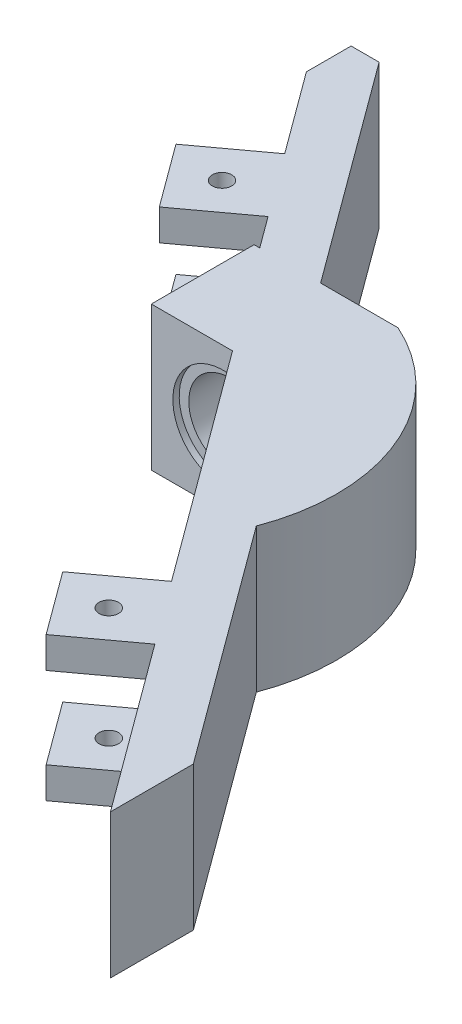
ISO-10303-21;
HEADER;
FILE_DESCRIPTION(('STEP AP214'),'2;1');
FILE_NAME('part.step','',(''),(''),'','','');
FILE_SCHEMA(('AUTOMOTIVE_DESIGN { 1 0 10303 214 1 1 1 1 }'));
ENDSEC;
DATA;
#1=APPLICATION_CONTEXT('core data for automotive mechanical design processes');
#2=APPLICATION_PROTOCOL_DEFINITION('international standard','automotive_design',2000,#1);
#3=PRODUCT_CONTEXT('',#1,'mechanical');
#4=PRODUCT('Part','Part','',(#3));
#5=PRODUCT_RELATED_PRODUCT_CATEGORY('part','',(#4));
#6=PRODUCT_DEFINITION_FORMATION('','',#4);
#7=PRODUCT_DEFINITION_CONTEXT('part definition',#1,'design');
#8=PRODUCT_DEFINITION('design','',#6,#7);
#9=PRODUCT_DEFINITION_SHAPE('','',#8);
#10=(LENGTH_UNIT() NAMED_UNIT(*) SI_UNIT(.MILLI.,.METRE.));
#11=(NAMED_UNIT(*) PLANE_ANGLE_UNIT() SI_UNIT($,.RADIAN.));
#12=(NAMED_UNIT(*) SI_UNIT($,.STERADIAN.) SOLID_ANGLE_UNIT());
#13=UNCERTAINTY_MEASURE_WITH_UNIT(LENGTH_MEASURE(1.E-05),#10,'distance_accuracy_value','');
#14=(GEOMETRIC_REPRESENTATION_CONTEXT(3) GLOBAL_UNCERTAINTY_ASSIGNED_CONTEXT((#13)) GLOBAL_UNIT_ASSIGNED_CONTEXT((#10,
#11,#12)) REPRESENTATION_CONTEXT('',''));
#15=CARTESIAN_POINT('',(0.,0.,0.));
#16=DIRECTION('',(0.,0.,1.));
#17=DIRECTION('',(1.,0.,0.));
#18=AXIS2_PLACEMENT_3D('',#15,#16,#17);
#19=CARTESIAN_POINT('',(0.,18.5,0.));
#20=DIRECTION('',(0.805831670150136,0.,-0.592144677746109));
#21=DIRECTION('',(-0.592144677746109,0.,-0.805831670150136));
#22=AXIS2_PLACEMENT_3D('',#19,#20,#21);
#23=PLANE('',#22);
#24=DIRECTION('',(0.,-1.,0.));
#25=VECTOR('',#24,1.);
#26=CARTESIAN_POINT('',(48.0556292359009,18.5,65.3974432645083));
#27=LINE('',#26,#25);
#28=CARTESIAN_POINT('',(48.0556292359009,18.5,65.3974432645083));
#29=VERTEX_POINT('',#28);
#30=CARTESIAN_POINT('',(48.0556292359009,14.5,65.3974432645083));
#31=VERTEX_POINT('',#30);
#32=EDGE_CURVE('E313',#29,#31,#27,.T.);
#33=ORIENTED_EDGE('',*,*,#32,.F.);
#34=DIRECTION('',(0.592144677746109,0.,0.805831670150136));
#35=VECTOR('',#34,1.);
#36=CARTESIAN_POINT('',(0.,18.5,0.));
#37=LINE('',#36,#35);
#38=CARTESIAN_POINT('',(26.3184133701517,18.5,35.8159277602497));
#39=VERTEX_POINT('',#38);
#40=EDGE_CURVE('E498',#39,#29,#37,.T.);
#41=ORIENTED_EDGE('',*,*,#40,.F.);
#42=DIRECTION('',(0.,1.,0.));
#43=VECTOR('',#42,1.);
#44=CARTESIAN_POINT('',(26.3184133701517,18.5,35.8159277602497));
#45=LINE('',#44,#43);
#46=CARTESIAN_POINT('',(26.3184133701517,15.6442222293234,35.8159277602497));
#47=VERTEX_POINT('',#46);
#48=EDGE_CURVE('E461',#47,#39,#45,.T.);
#49=ORIENTED_EDGE('',*,*,#48,.F.);
#50=CARTESIAN_POINT('',(25.1505426230111,9.25,34.2266080043585));
#51=DIRECTION('',(0.805831670150136,0.,-0.592144677746109));
#52=DIRECTION('',(-0.592144677746109,0.,-0.805831670150136));
#53=AXIS2_PLACEMENT_3D('',#50,#51,#52);
#54=ELLIPSE('',#53,10.9770470702212,6.5);
#55=CARTESIAN_POINT('',(26.3184133701517,2.8557777706766,35.8159277602497));
#56=VERTEX_POINT('',#55);
#57=EDGE_CURVE('E290',#56,#47,#54,.F.);
#58=ORIENTED_EDGE('',*,*,#57,.F.);
#59=CARTESIAN_POINT('',(26.3184133701517,0.,35.8159277602497));
#60=VERTEX_POINT('',#59);
#61=EDGE_CURVE('E462',#60,#56,#45,.T.);
#62=ORIENTED_EDGE('',*,*,#61,.F.);
#63=DIRECTION('',(0.592144677746109,0.,0.805831670150136));
#64=VECTOR('',#63,1.);
#65=CARTESIAN_POINT('',(0.,0.,0.));
#66=LINE('',#65,#64);
#67=CARTESIAN_POINT('',(48.0556292359009,0.,65.3974432645083));
#68=VERTEX_POINT('',#67);
#69=EDGE_CURVE('E272',#60,#68,#66,.T.);
#70=ORIENTED_EDGE('',*,*,#69,.T.);
#71=DIRECTION('',(0.,-1.,0.));
#72=VECTOR('',#71,1.);
#73=CARTESIAN_POINT('',(48.0556292359009,0.,65.3974432645083));
#74=LINE('',#73,#72);
#75=CARTESIAN_POINT('',(48.0556292359009,4.,65.3974432645083));
#76=VERTEX_POINT('',#75);
#77=EDGE_CURVE('E59',#76,#68,#74,.T.);
#78=ORIENTED_EDGE('',*,*,#77,.F.);
#79=DIRECTION('',(-0.592144677746109,0.,-0.805831670150136));
#80=VECTOR('',#79,1.);
#81=CARTESIAN_POINT('',(48.0556292359009,4.,65.3974432645083));
#82=LINE('',#81,#80);
#83=CARTESIAN_POINT('',(53.977076013362,4.,73.4557599660097));
#84=VERTEX_POINT('',#83);
#85=EDGE_CURVE('E341',#84,#76,#82,.T.);
#86=ORIENTED_EDGE('',*,*,#85,.F.);
#87=DIRECTION('',(0.,1.,0.));
#88=VECTOR('',#87,1.);
#89=CARTESIAN_POINT('',(53.977076013362,0.,73.4557599660097));
#90=LINE('',#89,#88);
#91=CARTESIAN_POINT('',(53.977076013362,0.,73.4557599660097));
#92=VERTEX_POINT('',#91);
#93=EDGE_CURVE('E349',#92,#84,#90,.T.);
#94=ORIENTED_EDGE('',*,*,#93,.F.);
#95=CARTESIAN_POINT('',(69.7928451016501,0.,94.978958768767));
#96=VERTEX_POINT('',#95);
#97=EDGE_CURVE('E271',#92,#96,#66,.T.);
#98=ORIENTED_EDGE('',*,*,#97,.T.);
#99=DIRECTION('',(0.,-1.,0.));
#100=VECTOR('',#99,1.);
#101=CARTESIAN_POINT('',(69.7928451016501,18.5,94.978958768767));
#102=LINE('',#101,#100);
#103=CARTESIAN_POINT('',(69.7928451016501,18.5,94.978958768767));
#104=VERTEX_POINT('',#103);
#105=EDGE_CURVE('E43',#104,#96,#102,.T.);
#106=ORIENTED_EDGE('',*,*,#105,.F.);
#107=CARTESIAN_POINT('',(53.977076013362,18.5,73.4557599660097));
#108=VERTEX_POINT('',#107);
#109=EDGE_CURVE('E249',#108,#104,#37,.T.);
#110=ORIENTED_EDGE('',*,*,#109,.F.);
#111=DIRECTION('',(0.,1.,0.));
#112=VECTOR('',#111,1.);
#113=CARTESIAN_POINT('',(53.977076013362,18.5,73.4557599660097));
#114=LINE('',#113,#112);
#115=CARTESIAN_POINT('',(53.977076013362,14.5,73.4557599660097));
#116=VERTEX_POINT('',#115);
#117=EDGE_CURVE('E318',#116,#108,#114,.T.);
#118=ORIENTED_EDGE('',*,*,#117,.F.);
#119=DIRECTION('',(0.592144677746109,0.,0.805831670150136));
#120=VECTOR('',#119,1.);
#121=CARTESIAN_POINT('',(48.0556292359009,14.5,65.3974432645083));
#122=LINE('',#121,#120);
#123=EDGE_CURVE('E327',#31,#116,#122,.T.);
#124=ORIENTED_EDGE('',*,*,#123,.F.);
#125=EDGE_LOOP('',(#33,#41,#49,#58,#62,#70,#78,#86,#94,#98,#106,#110,#118,#124));
#126=FACE_BOUND('',#125,.T.);
#127=ADVANCED_FACE('F34',(#126),#23,.F.);
#128=DIRECTION('',(0.,-1.,0.));
#129=VECTOR('',#128,1.);
#130=CARTESIAN_POINT('',(7.72742137235511,18.5,10.5160125632484));
#131=LINE('',#130,#129);
#132=CARTESIAN_POINT('',(7.72742137235511,18.5,10.5160125632484));
#133=VERTEX_POINT('',#132);
#134=CARTESIAN_POINT('',(7.72742137235511,14.5,10.5160125632484));
#135=VERTEX_POINT('',#134);
#136=EDGE_CURVE('E364',#133,#135,#131,.T.);
#137=ORIENTED_EDGE('',*,*,#136,.F.);
#138=CARTESIAN_POINT('',(0.,18.5,0.));
#139=VERTEX_POINT('',#138);
#140=EDGE_CURVE('E261',#139,#133,#37,.T.);
#141=ORIENTED_EDGE('',*,*,#140,.F.);
#142=DIRECTION('',(0.,-1.,0.));
#143=VECTOR('',#142,1.);
#144=CARTESIAN_POINT('',(0.,18.5,0.));
#145=LINE('',#144,#143);
#146=CARTESIAN_POINT('',(0.,0.,0.));
#147=VERTEX_POINT('',#146);
#148=EDGE_CURVE('E266',#139,#147,#145,.T.);
#149=ORIENTED_EDGE('',*,*,#148,.T.);
#150=CARTESIAN_POINT('',(7.72742137235511,0.,10.5160125632484));
#151=VERTEX_POINT('',#150);
#152=EDGE_CURVE('E267',#147,#151,#66,.T.);
#153=ORIENTED_EDGE('',*,*,#152,.T.);
#154=DIRECTION('',(0.,-1.,0.));
#155=VECTOR('',#154,1.);
#156=CARTESIAN_POINT('',(7.72742137235511,0.,10.5160125632484));
#157=LINE('',#156,#155);
#158=CARTESIAN_POINT('',(7.72742137235511,4.,10.5160125632484));
#159=VERTEX_POINT('',#158);
#160=EDGE_CURVE('E395',#159,#151,#157,.T.);
#161=ORIENTED_EDGE('',*,*,#160,.F.);
#162=DIRECTION('',(-0.592144677746109,0.,-0.805831670150136));
#163=VECTOR('',#162,1.);
#164=CARTESIAN_POINT('',(7.72742137235511,4.,10.5160125632484));
#165=LINE('',#164,#163);
#166=CARTESIAN_POINT('',(13.6488681498162,4.,18.5743292647498));
#167=VERTEX_POINT('',#166);
#168=EDGE_CURVE('E404',#167,#159,#165,.T.);
#169=ORIENTED_EDGE('',*,*,#168,.F.);
#170=DIRECTION('',(0.,1.,0.));
#171=VECTOR('',#170,1.);
#172=CARTESIAN_POINT('',(13.6488681498162,4.,18.5743292647498));
#173=LINE('',#172,#171);
#174=CARTESIAN_POINT('',(13.6488681498162,0.,18.5743292647498));
#175=VERTEX_POINT('',#174);
#176=EDGE_CURVE('E390',#175,#167,#173,.T.);
#177=ORIENTED_EDGE('',*,*,#176,.F.);
#178=CARTESIAN_POINT('',(16.6095915385467,0.,22.6034876155005));
#179=VERTEX_POINT('',#178);
#180=EDGE_CURVE('E270',#175,#179,#66,.T.);
#181=ORIENTED_EDGE('',*,*,#180,.T.);
#182=DIRECTION('',(0.,-1.,0.));
#183=VECTOR('',#182,1.);
#184=CARTESIAN_POINT('',(16.6095915385467,18.5,22.6034876155005));
#185=LINE('',#184,#183);
#186=CARTESIAN_POINT('',(16.6095915385467,18.5,22.6034876155005));
#187=VERTEX_POINT('',#186);
#188=EDGE_CURVE('E468',#187,#179,#185,.T.);
#189=ORIENTED_EDGE('',*,*,#188,.F.);
#190=CARTESIAN_POINT('',(13.6488681498162,18.5,18.5743292647498));
#191=VERTEX_POINT('',#190);
#192=EDGE_CURVE('E494',#191,#187,#37,.T.);
#193=ORIENTED_EDGE('',*,*,#192,.F.);
#194=DIRECTION('',(0.,1.,0.));
#195=VECTOR('',#194,1.);
#196=CARTESIAN_POINT('',(13.6488681498162,14.5,18.5743292647498));
#197=LINE('',#196,#195);
#198=CARTESIAN_POINT('',(13.6488681498162,14.5,18.5743292647498));
#199=VERTEX_POINT('',#198);
#200=EDGE_CURVE('E369',#199,#191,#197,.T.);
#201=ORIENTED_EDGE('',*,*,#200,.F.);
#202=DIRECTION('',(0.592144677746109,0.,0.805831670150136));
#203=VECTOR('',#202,1.);
#204=CARTESIAN_POINT('',(7.72742137235511,14.5,10.5160125632484));
#205=LINE('',#204,#203);
#206=EDGE_CURVE('E377',#135,#199,#205,.T.);
#207=ORIENTED_EDGE('',*,*,#206,.F.);
#208=EDGE_LOOP('',(#137,#141,#149,#153,#161,#169,#177,#181,#189,#193,#201,#207));
#209=FACE_BOUND('',#208,.T.);
#210=ADVANCED_FACE('F36',(#209),#23,.F.);
#211=CARTESIAN_POINT('',(25.134167429386,9.25,-5.75));
#212=DIRECTION('',(0.,0.,1.));
#213=DIRECTION('',(1.,0.,0.));
#214=AXIS2_PLACEMENT_3D('',#211,#212,#213);
#215=CYLINDRICAL_SURFACE('',#214,5.25);
#216=CARTESIAN_POINT('',(25.134167429386,9.25,22.6034876155005));
#217=DIRECTION('',(0.,0.,1.));
#218=DIRECTION('',(1.,0.,0.));
#219=AXIS2_PLACEMENT_3D('',#216,#217,#218);
#220=CIRCLE('',#219,5.25);
#221=CARTESIAN_POINT('',(24.4348311551602,4.04678668748321,22.6034876155005));
#222=VERTEX_POINT('',#221);
#223=CARTESIAN_POINT('',(24.4348311551602,14.4532133125168,22.6034876155005));
#224=VERTEX_POINT('',#223);
#225=EDGE_CURVE('E428',#222,#224,#220,.T.);
#226=ORIENTED_EDGE('',*,*,#225,.F.);
#227=CARTESIAN_POINT('',(25.134167429386,9.25,23.555193066947));
#228=DIRECTION('',(-0.805831670150136,0.,0.592144677746108));
#229=DIRECTION('',(0.592144677746108,0.,0.805831670150136));
#230=AXIS2_PLACEMENT_3D('',#227,#228,#229);
#231=ELLIPSE('',#230,8.86607647979405,5.25);
#232=EDGE_CURVE('E431',#224,#222,#231,.T.);
#233=ORIENTED_EDGE('',*,*,#232,.F.);
#234=EDGE_LOOP('',(#226,#233));
#235=FACE_BOUND('',#234,.T.);
#236=CARTESIAN_POINT('',(25.134167429386,9.25,35.));
#237=DIRECTION('',(0.,0.,1.));
#238=DIRECTION('',(1.,0.,0.));
#239=AXIS2_PLACEMENT_3D('',#236,#237,#238);
#240=CIRCLE('',#239,5.25);
#241=CARTESIAN_POINT('',(30.384167429386,9.25,35.));
#242=VERTEX_POINT('',#241);
#243=EDGE_CURVE('E288',#242,#242,#240,.F.);
#244=ORIENTED_EDGE('',*,*,#243,.F.);
#245=EDGE_LOOP('',(#244));
#246=FACE_BOUND('',#245,.T.);
#247=ADVANCED_FACE('F550',(#235,#246),#215,.F.);
#248=CARTESIAN_POINT('',(3.6,18.5,-5.75));
#249=DIRECTION('',(-0.805831670150136,0.,0.592144677746108));
#250=DIRECTION('',(0.592144677746108,0.,0.805831670150136));
#251=AXIS2_PLACEMENT_3D('',#248,#249,#250);
#252=PLANE('',#251);
#253=DIRECTION('',(-0.592144677746108,0.,-0.805831670150136));
#254=VECTOR('',#253,1.);
#255=CARTESIAN_POINT('',(3.6,18.5,-5.75));
#256=LINE('',#255,#254);
#257=CARTESIAN_POINT('',(69.7928451016501,18.5,84.3298283339844));
#258=VERTEX_POINT('',#257);
#259=CARTESIAN_POINT('',(47.3473379085571,18.5,53.7844207190361));
#260=VERTEX_POINT('',#259);
#261=EDGE_CURVE('E246',#258,#260,#256,.T.);
#262=ORIENTED_EDGE('',*,*,#261,.F.);
#263=DIRECTION('',(0.,1.,0.));
#264=VECTOR('',#263,1.);
#265=CARTESIAN_POINT('',(69.7928451016501,-0.001000000000001,84.3298283339844));
#266=LINE('',#265,#264);
#267=CARTESIAN_POINT('',(69.7928451016501,0.,84.3298283339844));
#268=VERTEX_POINT('',#267);
#269=EDGE_CURVE('E233',#268,#258,#266,.T.);
#270=ORIENTED_EDGE('',*,*,#269,.F.);
#271=DIRECTION('',(-0.592144677746108,0.,-0.805831670150136));
#272=VECTOR('',#271,1.);
#273=CARTESIAN_POINT('',(3.6,0.,-5.75));
#274=LINE('',#273,#272);
#275=CARTESIAN_POINT('',(47.3473379085571,0.,53.7844207190361));
#276=VERTEX_POINT('',#275);
#277=EDGE_CURVE('E273',#268,#276,#274,.T.);
#278=ORIENTED_EDGE('',*,*,#277,.T.);
#279=DIRECTION('',(0.,-1.,0.));
#280=VECTOR('',#279,1.);
#281=CARTESIAN_POINT('',(47.3473379085571,18.5,53.7844207190361));
#282=LINE('',#281,#280);
#283=EDGE_CURVE('E255',#260,#276,#282,.T.);
#284=ORIENTED_EDGE('',*,*,#283,.F.);
#285=EDGE_LOOP('',(#262,#270,#278,#284));
#286=FACE_BOUND('',#285,.T.);
#287=ADVANCED_FACE('F253',(#286),#252,.F.);
#288=DIRECTION('',(0.,1.,0.));
#289=VECTOR('',#288,1.);
#290=CARTESIAN_POINT('',(24.4348311551602,18.5,22.6034876155005));
#291=LINE('',#290,#289);
#292=CARTESIAN_POINT('',(24.4348311551602,18.5,22.6034876155005));
#293=VERTEX_POINT('',#292);
#294=EDGE_CURVE('E465',#224,#293,#291,.T.);
#295=ORIENTED_EDGE('',*,*,#294,.F.);
#296=ORIENTED_EDGE('',*,*,#232,.T.);
#297=CARTESIAN_POINT('',(24.4348311551602,0.,22.6034876155005));
#298=VERTEX_POINT('',#297);
#299=EDGE_CURVE('E466',#298,#222,#291,.T.);
#300=ORIENTED_EDGE('',*,*,#299,.F.);
#301=CARTESIAN_POINT('',(3.6,0.,-5.75));
#302=VERTEX_POINT('',#301);
#303=EDGE_CURVE('E269',#298,#302,#274,.T.);
#304=ORIENTED_EDGE('',*,*,#303,.T.);
#305=DIRECTION('',(0.,-1.,0.));
#306=VECTOR('',#305,1.);
#307=CARTESIAN_POINT('',(3.6,18.5,-5.75));
#308=LINE('',#307,#306);
#309=CARTESIAN_POINT('',(3.6,18.5,-5.75));
#310=VERTEX_POINT('',#309);
#311=EDGE_CURVE('E284',#310,#302,#308,.T.);
#312=ORIENTED_EDGE('',*,*,#311,.F.);
#313=EDGE_CURVE('E257',#293,#310,#256,.T.);
#314=ORIENTED_EDGE('',*,*,#313,.F.);
#315=EDGE_LOOP('',(#295,#296,#300,#304,#312,#314));
#316=FACE_BOUND('',#315,.T.);
#317=ADVANCED_FACE('F559',(#316),#252,.F.);
#318=CARTESIAN_POINT('',(0.,18.5,-5.75));
#319=DIRECTION('',(0.,0.,1.));
#320=DIRECTION('',(1.,0.,0.));
#321=AXIS2_PLACEMENT_3D('',#318,#319,#320);
#322=PLANE('',#321);
#323=DIRECTION('',(-1.,0.,0.));
#324=VECTOR('',#323,1.);
#325=CARTESIAN_POINT('',(0.,0.,-5.75));
#326=LINE('',#325,#324);
#327=CARTESIAN_POINT('',(0.,0.,-5.75));
#328=VERTEX_POINT('',#327);
#329=EDGE_CURVE('E275',#302,#328,#326,.T.);
#330=ORIENTED_EDGE('',*,*,#329,.T.);
#331=DIRECTION('',(0.,-1.,0.));
#332=VECTOR('',#331,1.);
#333=CARTESIAN_POINT('',(0.,18.5,-5.75));
#334=LINE('',#333,#332);
#335=CARTESIAN_POINT('',(0.,18.5,-5.75));
#336=VERTEX_POINT('',#335);
#337=EDGE_CURVE('E281',#336,#328,#334,.T.);
#338=ORIENTED_EDGE('',*,*,#337,.F.);
#339=DIRECTION('',(-1.,0.,0.));
#340=VECTOR('',#339,1.);
#341=CARTESIAN_POINT('',(0.,18.5,-5.75));
#342=LINE('',#341,#340);
#343=EDGE_CURVE('E256',#310,#336,#342,.T.);
#344=ORIENTED_EDGE('',*,*,#343,.F.);
#345=ORIENTED_EDGE('',*,*,#311,.T.);
#346=EDGE_LOOP('',(#330,#338,#344,#345));
#347=FACE_BOUND('',#346,.T.);
#348=ADVANCED_FACE('F582',(#347),#322,.F.);
#349=CARTESIAN_POINT('',(0.,18.5,0.));
#350=DIRECTION('',(1.,0.,0.));
#351=DIRECTION('',(0.,0.,-1.));
#352=AXIS2_PLACEMENT_3D('',#349,#350,#351);
#353=PLANE('',#352);
#354=DIRECTION('',(0.,0.,1.));
#355=VECTOR('',#354,1.);
#356=CARTESIAN_POINT('',(0.,0.,0.));
#357=LINE('',#356,#355);
#358=EDGE_CURVE('E277',#328,#147,#357,.T.);
#359=ORIENTED_EDGE('',*,*,#358,.T.);
#360=ORIENTED_EDGE('',*,*,#148,.F.);
#361=DIRECTION('',(0.,0.,1.));
#362=VECTOR('',#361,1.);
#363=CARTESIAN_POINT('',(0.,18.5,0.));
#364=LINE('',#363,#362);
#365=EDGE_CURVE('E259',#336,#139,#364,.T.);
#366=ORIENTED_EDGE('',*,*,#365,.F.);
#367=ORIENTED_EDGE('',*,*,#337,.T.);
#368=EDGE_LOOP('',(#359,#360,#366,#367));
#369=FACE_BOUND('',#368,.T.);
#370=ADVANCED_FACE('F576',(#369),#353,.F.);
#371=CARTESIAN_POINT('',(0.,18.5,0.));
#372=DIRECTION('',(0.,1.,0.));
#373=DIRECTION('',(0.,0.,1.));
#374=AXIS2_PLACEMENT_3D('',#371,#372,#373);
#375=PLANE('',#374);
#376=DIRECTION('',(0.,0.,1.));
#377=VECTOR('',#376,1.);
#378=CARTESIAN_POINT('',(69.7928451016501,18.5,84.3298283339844));
#379=LINE('',#378,#377);
#380=EDGE_CURVE('E236',#258,#104,#379,.T.);
#381=ORIENTED_EDGE('',*,*,#380,.F.);
#382=ORIENTED_EDGE('',*,*,#261,.T.);
#383=CARTESIAN_POINT('',(24.3641086625419,18.5,45.0543525951038));
#384=DIRECTION('',(0.,1.,0.));
#385=DIRECTION('',(0.,0.,-1.));
#386=AXIS2_PLACEMENT_3D('',#383,#384,#385);
#387=CIRCLE('',#386,24.5854208022435);
#388=CARTESIAN_POINT('',(34.384167429386,18.5,22.6034876155005));
#389=VERTEX_POINT('',#388);
#390=EDGE_CURVE('E424',#260,#389,#387,.T.);
#391=ORIENTED_EDGE('',*,*,#390,.T.);
#392=DIRECTION('',(-1.,0.,0.));
#393=VECTOR('',#392,1.);
#394=CARTESIAN_POINT('',(34.384167429386,18.5,22.6034876155005));
#395=LINE('',#394,#393);
#396=EDGE_CURVE('E435',#389,#293,#395,.T.);
#397=ORIENTED_EDGE('',*,*,#396,.T.);
#398=ORIENTED_EDGE('',*,*,#313,.T.);
#399=ORIENTED_EDGE('',*,*,#343,.T.);
#400=ORIENTED_EDGE('',*,*,#365,.T.);
#401=ORIENTED_EDGE('',*,*,#140,.T.);
#402=DIRECTION('',(0.805831670150136,0.,-0.592144677746109));
#403=VECTOR('',#402,1.);
#404=CARTESIAN_POINT('',(-0.330895329146244,18.5,16.4374593407095));
#405=LINE('',#404,#403);
#406=CARTESIAN_POINT('',(-0.330895329146244,18.5,16.4374593407095));
#407=VERTEX_POINT('',#406);
#408=EDGE_CURVE('E388',#407,#133,#405,.T.);
#409=ORIENTED_EDGE('',*,*,#408,.F.);
#410=DIRECTION('',(-0.592144677746109,0.,-0.805831670150136));
#411=VECTOR('',#410,1.);
#412=CARTESIAN_POINT('',(-0.330895329146244,18.5,16.4374593407095));
#413=LINE('',#412,#411);
#414=CARTESIAN_POINT('',(5.59055144831484,18.5,24.4957760422109));
#415=VERTEX_POINT('',#414);
#416=EDGE_CURVE('E365',#415,#407,#413,.T.);
#417=ORIENTED_EDGE('',*,*,#416,.F.);
#418=DIRECTION('',(0.805831670150136,0.,-0.592144677746109));
#419=VECTOR('',#418,1.);
#420=CARTESIAN_POINT('',(5.59055144831484,18.5,24.4957760422109));
#421=LINE('',#420,#419);
#422=EDGE_CURVE('E375',#415,#191,#421,.T.);
#423=ORIENTED_EDGE('',*,*,#422,.T.);
#424=ORIENTED_EDGE('',*,*,#192,.T.);
#425=CARTESIAN_POINT('',(15.884167429386,18.5,22.6034876155005));
#426=VERTEX_POINT('',#425);
#427=EDGE_CURVE('E439',#187,#426,#395,.T.);
#428=ORIENTED_EDGE('',*,*,#427,.T.);
#429=DIRECTION('',(0.,0.,1.));
#430=VECTOR('',#429,1.);
#431=CARTESIAN_POINT('',(15.884167429386,18.5,22.6034876155005));
#432=LINE('',#431,#430);
#433=CARTESIAN_POINT('',(15.884167429386,18.5,35.8159277602497));
#434=VERTEX_POINT('',#433);
#435=EDGE_CURVE('E438',#426,#434,#432,.T.);
#436=ORIENTED_EDGE('',*,*,#435,.T.);
#437=DIRECTION('',(1.,0.,0.));
#438=VECTOR('',#437,1.);
#439=CARTESIAN_POINT('',(15.884167429386,18.5,35.8159277602497));
#440=LINE('',#439,#438);
#441=EDGE_CURVE('E441',#434,#39,#440,.T.);
#442=ORIENTED_EDGE('',*,*,#441,.T.);
#443=ORIENTED_EDGE('',*,*,#40,.T.);
#444=DIRECTION('',(0.805831670150136,0.,-0.592144677746109));
#445=VECTOR('',#444,1.);
#446=CARTESIAN_POINT('',(39.9973125343995,18.5,71.3188900419694));
#447=LINE('',#446,#445);
#448=CARTESIAN_POINT('',(39.9973125343995,18.5,71.3188900419694));
#449=VERTEX_POINT('',#448);
#450=EDGE_CURVE('E324',#449,#29,#447,.T.);
#451=ORIENTED_EDGE('',*,*,#450,.F.);
#452=DIRECTION('',(-0.592144677746109,0.,-0.805831670150136));
#453=VECTOR('',#452,1.);
#454=CARTESIAN_POINT('',(39.9973125343995,18.5,71.3188900419694));
#455=LINE('',#454,#453);
#456=CARTESIAN_POINT('',(45.9187593118606,18.5,79.3772067434708));
#457=VERTEX_POINT('',#456);
#458=EDGE_CURVE('E322',#457,#449,#455,.T.);
#459=ORIENTED_EDGE('',*,*,#458,.F.);
#460=DIRECTION('',(0.805831670150136,0.,-0.592144677746109));
#461=VECTOR('',#460,1.);
#462=CARTESIAN_POINT('',(45.9187593118606,18.5,79.3772067434708));
#463=LINE('',#462,#461);
#464=EDGE_CURVE('E51',#457,#108,#463,.T.);
#465=ORIENTED_EDGE('',*,*,#464,.T.);
#466=ORIENTED_EDGE('',*,*,#109,.T.);
#467=EDGE_LOOP('',(#381,#382,#391,#397,#398,#399,#400,#401,#409,#417,#423,#424,#428,#436,#442,
#443,#451,#459,#465,#466));
#468=FACE_BOUND('',#467,.T.);
#469=CARTESIAN_POINT('',(46.9871942738808,18.5,72.3873250039896));
#470=DIRECTION('',(0.,1.,0.));
#471=DIRECTION('',(0.,0.,1.));
#472=AXIS2_PLACEMENT_3D('',#469,#470,#471);
#473=CIRCLE('',#472,1.25);
#474=CARTESIAN_POINT('',(46.9871942738808,18.5,73.6373250039896));
#475=VERTEX_POINT('',#474);
#476=EDGE_CURVE('E302',#475,#475,#473,.T.);
#477=ORIENTED_EDGE('',*,*,#476,.F.);
#478=EDGE_LOOP('',(#477));
#479=FACE_BOUND('',#478,.T.);
#480=CARTESIAN_POINT('',(6.65898641033497,18.5,17.5058943027297));
#481=DIRECTION('',(0.,1.,0.));
#482=DIRECTION('',(0.,0.,1.));
#483=AXIS2_PLACEMENT_3D('',#480,#481,#482);
#484=CIRCLE('',#483,1.25);
#485=CARTESIAN_POINT('',(6.65898641033497,18.5,18.7558943027297));
#486=VERTEX_POINT('',#485);
#487=EDGE_CURVE('E299',#486,#486,#484,.T.);
#488=ORIENTED_EDGE('',*,*,#487,.F.);
#489=EDGE_LOOP('',(#488));
#490=FACE_BOUND('',#489,.T.);
#491=ADVANCED_FACE('F244',(#468,#479,#490),#375,.T.);
#492=CARTESIAN_POINT('',(0.,0.,0.));
#493=DIRECTION('',(0.,1.,0.));
#494=DIRECTION('',(0.,0.,1.));
#495=AXIS2_PLACEMENT_3D('',#492,#493,#494);
#496=PLANE('',#495);
#497=CARTESIAN_POINT('',(46.9871942738808,0.,72.3873250039896));
#498=DIRECTION('',(0.,1.,0.));
#499=DIRECTION('',(0.,0.,1.));
#500=AXIS2_PLACEMENT_3D('',#497,#498,#499);
#501=CIRCLE('',#500,1.25);
#502=CARTESIAN_POINT('',(46.9871942738808,0.,73.6373250039896));
#503=VERTEX_POINT('',#502);
#504=EDGE_CURVE('E242',#503,#503,#501,.T.);
#505=ORIENTED_EDGE('',*,*,#504,.T.);
#506=EDGE_LOOP('',(#505));
#507=FACE_BOUND('',#506,.T.);
#508=CARTESIAN_POINT('',(6.65898641033497,0.,17.5058943027297));
#509=DIRECTION('',(0.,1.,0.));
#510=DIRECTION('',(0.,0.,1.));
#511=AXIS2_PLACEMENT_3D('',#508,#509,#510);
#512=CIRCLE('',#511,1.25);
#513=CARTESIAN_POINT('',(6.65898641033497,0.,18.7558943027297));
#514=VERTEX_POINT('',#513);
#515=EDGE_CURVE('E295',#514,#514,#512,.T.);
#516=ORIENTED_EDGE('',*,*,#515,.T.);
#517=EDGE_LOOP('',(#516));
#518=FACE_BOUND('',#517,.T.);
#519=ORIENTED_EDGE('',*,*,#277,.F.);
#520=DIRECTION('',(0.,0.,-1.));
#521=VECTOR('',#520,1.);
#522=CARTESIAN_POINT('',(69.7928451016501,0.,84.3298283339844));
#523=LINE('',#522,#521);
#524=EDGE_CURVE('E238',#96,#268,#523,.T.);
#525=ORIENTED_EDGE('',*,*,#524,.F.);
#526=ORIENTED_EDGE('',*,*,#97,.F.);
#527=DIRECTION('',(0.805831670150136,0.,-0.592144677746109));
#528=VECTOR('',#527,1.);
#529=CARTESIAN_POINT('',(45.9187593118606,0.,79.3772067434708));
#530=LINE('',#529,#528);
#531=CARTESIAN_POINT('',(45.9187593118606,0.,79.3772067434708));
#532=VERTEX_POINT('',#531);
#533=EDGE_CURVE('E358',#532,#92,#530,.T.);
#534=ORIENTED_EDGE('',*,*,#533,.F.);
#535=DIRECTION('',(0.592144677746109,0.,0.805831670150136));
#536=VECTOR('',#535,1.);
#537=CARTESIAN_POINT('',(39.9973125343995,0.,71.3188900419694));
#538=LINE('',#537,#536);
#539=CARTESIAN_POINT('',(39.9973125343995,0.,71.3188900419694));
#540=VERTEX_POINT('',#539);
#541=EDGE_CURVE('E340',#540,#532,#538,.T.);
#542=ORIENTED_EDGE('',*,*,#541,.F.);
#543=DIRECTION('',(0.805831670150136,0.,-0.592144677746109));
#544=VECTOR('',#543,1.);
#545=CARTESIAN_POINT('',(39.9973125343995,0.,71.3188900419694));
#546=LINE('',#545,#544);
#547=EDGE_CURVE('E361',#540,#68,#546,.T.);
#548=ORIENTED_EDGE('',*,*,#547,.T.);
#549=ORIENTED_EDGE('',*,*,#69,.F.);
#550=DIRECTION('',(1.,0.,0.));
#551=VECTOR('',#550,1.);
#552=CARTESIAN_POINT('',(15.884167429386,0.,35.8159277602497));
#553=LINE('',#552,#551);
#554=CARTESIAN_POINT('',(15.884167429386,0.,35.8159277602497));
#555=VERTEX_POINT('',#554);
#556=EDGE_CURVE('E450',#555,#60,#553,.T.);
#557=ORIENTED_EDGE('',*,*,#556,.F.);
#558=DIRECTION('',(0.,0.,1.));
#559=VECTOR('',#558,1.);
#560=CARTESIAN_POINT('',(15.884167429386,0.,22.6034876155005));
#561=LINE('',#560,#559);
#562=CARTESIAN_POINT('',(15.884167429386,0.,22.6034876155005));
#563=VERTEX_POINT('',#562);
#564=EDGE_CURVE('E448',#563,#555,#561,.T.);
#565=ORIENTED_EDGE('',*,*,#564,.F.);
#566=DIRECTION('',(-1.,0.,0.));
#567=VECTOR('',#566,1.);
#568=CARTESIAN_POINT('',(34.384167429386,0.,22.6034876155005));
#569=LINE('',#568,#567);
#570=EDGE_CURVE('E434',#179,#563,#569,.T.);
#571=ORIENTED_EDGE('',*,*,#570,.F.);
#572=ORIENTED_EDGE('',*,*,#180,.F.);
#573=DIRECTION('',(0.805831670150136,0.,-0.592144677746109));
#574=VECTOR('',#573,1.);
#575=CARTESIAN_POINT('',(5.59055144831484,0.,24.4957760422109));
#576=LINE('',#575,#574);
#577=CARTESIAN_POINT('',(5.59055144831484,0.,24.4957760422109));
#578=VERTEX_POINT('',#577);
#579=EDGE_CURVE('E417',#578,#175,#576,.T.);
#580=ORIENTED_EDGE('',*,*,#579,.F.);
#581=DIRECTION('',(0.592144677746109,0.,0.805831670150136));
#582=VECTOR('',#581,1.);
#583=CARTESIAN_POINT('',(5.59055144831484,0.,24.4957760422109));
#584=LINE('',#583,#582);
#585=CARTESIAN_POINT('',(-0.330895329146244,0.,16.4374593407095));
#586=VERTEX_POINT('',#585);
#587=EDGE_CURVE('E391',#586,#578,#584,.T.);
#588=ORIENTED_EDGE('',*,*,#587,.F.);
#589=DIRECTION('',(0.805831670150136,0.,-0.592144677746109));
#590=VECTOR('',#589,1.);
#591=CARTESIAN_POINT('',(-0.330895329146244,0.,16.4374593407095));
#592=LINE('',#591,#590);
#593=EDGE_CURVE('E401',#586,#151,#592,.T.);
#594=ORIENTED_EDGE('',*,*,#593,.T.);
#595=ORIENTED_EDGE('',*,*,#152,.F.);
#596=ORIENTED_EDGE('',*,*,#358,.F.);
#597=ORIENTED_EDGE('',*,*,#329,.F.);
#598=ORIENTED_EDGE('',*,*,#303,.F.);
#599=CARTESIAN_POINT('',(34.384167429386,0.,22.6034876155005));
#600=VERTEX_POINT('',#599);
#601=EDGE_CURVE('E445',#600,#298,#569,.T.);
#602=ORIENTED_EDGE('',*,*,#601,.F.);
#603=CARTESIAN_POINT('',(24.3641086625419,0.,45.0543525951038));
#604=DIRECTION('',(0.,1.,0.));
#605=DIRECTION('',(0.,0.,-1.));
#606=AXIS2_PLACEMENT_3D('',#603,#604,#605);
#607=CIRCLE('',#606,24.5854208022435);
#608=EDGE_CURVE('E423',#276,#600,#607,.T.);
#609=ORIENTED_EDGE('',*,*,#608,.F.);
#610=EDGE_LOOP('',(#519,#525,#526,#534,#542,#548,#549,#557,#565,#571,#572,#580,#588,#594,#595,
#596,#597,#598,#602,#609));
#611=FACE_BOUND('',#610,.T.);
#612=ADVANCED_FACE('F482',(#507,#518,#611),#496,.F.);
#613=CARTESIAN_POINT('',(34.384167429386,18.5,22.6034876155005));
#614=DIRECTION('',(0.,0.,1.));
#615=DIRECTION('',(1.,0.,0.));
#616=AXIS2_PLACEMENT_3D('',#613,#614,#615);
#617=PLANE('',#616);
#618=ORIENTED_EDGE('',*,*,#299,.T.);
#619=ORIENTED_EDGE('',*,*,#225,.T.);
#620=ORIENTED_EDGE('',*,*,#294,.T.);
#621=ORIENTED_EDGE('',*,*,#396,.F.);
#622=DIRECTION('',(0.,-1.,0.));
#623=VECTOR('',#622,1.);
#624=CARTESIAN_POINT('',(34.384167429386,18.5,22.6034876155005));
#625=LINE('',#624,#623);
#626=EDGE_CURVE('E444',#389,#600,#625,.T.);
#627=ORIENTED_EDGE('',*,*,#626,.T.);
#628=ORIENTED_EDGE('',*,*,#601,.T.);
#629=EDGE_LOOP('',(#618,#619,#620,#621,#627,#628));
#630=FACE_BOUND('',#629,.T.);
#631=ADVANCED_FACE('F573',(#630),#617,.F.);
#632=ORIENTED_EDGE('',*,*,#427,.F.);
#633=ORIENTED_EDGE('',*,*,#188,.T.);
#634=ORIENTED_EDGE('',*,*,#570,.T.);
#635=DIRECTION('',(0.,-1.,0.));
#636=VECTOR('',#635,1.);
#637=CARTESIAN_POINT('',(15.884167429386,18.5,22.6034876155005));
#638=LINE('',#637,#636);
#639=EDGE_CURVE('E458',#426,#563,#638,.T.);
#640=ORIENTED_EDGE('',*,*,#639,.F.);
#641=EDGE_LOOP('',(#632,#633,#634,#640));
#642=FACE_BOUND('',#641,.T.);
#643=ADVANCED_FACE('F487',(#642),#617,.F.);
#644=CARTESIAN_POINT('',(15.884167429386,18.5,35.8159277602497));
#645=DIRECTION('',(0.,0.,-1.));
#646=DIRECTION('',(-1.,0.,0.));
#647=AXIS2_PLACEMENT_3D('',#644,#645,#646);
#648=PLANE('',#647);
#649=CARTESIAN_POINT('',(25.1505426230111,9.25,35.8159277602497));
#650=DIRECTION('',(0.,0.,-1.));
#651=DIRECTION('',(-1.,0.,0.));
#652=AXIS2_PLACEMENT_3D('',#649,#650,#651);
#653=CIRCLE('',#652,6.5);
#654=EDGE_CURVE('E11',#47,#56,#653,.F.);
#655=ORIENTED_EDGE('',*,*,#654,.F.);
#656=ORIENTED_EDGE('',*,*,#48,.T.);
#657=ORIENTED_EDGE('',*,*,#441,.F.);
#658=DIRECTION('',(0.,-1.,0.));
#659=VECTOR('',#658,1.);
#660=CARTESIAN_POINT('',(15.884167429386,18.5,35.8159277602497));
#661=LINE('',#660,#659);
#662=EDGE_CURVE('E455',#434,#555,#661,.T.);
#663=ORIENTED_EDGE('',*,*,#662,.T.);
#664=ORIENTED_EDGE('',*,*,#556,.T.);
#665=ORIENTED_EDGE('',*,*,#61,.T.);
#666=EDGE_LOOP('',(#655,#656,#657,#663,#664,#665));
#667=FACE_BOUND('',#666,.T.);
#668=ADVANCED_FACE('F565',(#667),#648,.F.);
#669=CARTESIAN_POINT('',(15.884167429386,18.5,22.6034876155005));
#670=DIRECTION('',(1.,0.,0.));
#671=DIRECTION('',(0.,0.,-1.));
#672=AXIS2_PLACEMENT_3D('',#669,#670,#671);
#673=PLANE('',#672);
#674=ORIENTED_EDGE('',*,*,#564,.T.);
#675=ORIENTED_EDGE('',*,*,#662,.F.);
#676=ORIENTED_EDGE('',*,*,#435,.F.);
#677=ORIENTED_EDGE('',*,*,#639,.T.);
#678=EDGE_LOOP('',(#674,#675,#676,#677));
#679=FACE_BOUND('',#678,.T.);
#680=ADVANCED_FACE('F490',(#679),#673,.F.);
#681=CARTESIAN_POINT('',(24.3641086625419,18.5,45.0543525951038));
#682=DIRECTION('',(0.,-1.,0.));
#683=DIRECTION('',(0.,0.,-1.));
#684=AXIS2_PLACEMENT_3D('',#681,#682,#683);
#685=CYLINDRICAL_SURFACE('',#684,24.5854208022435);
#686=ORIENTED_EDGE('',*,*,#608,.T.);
#687=ORIENTED_EDGE('',*,*,#626,.F.);
#688=ORIENTED_EDGE('',*,*,#390,.F.);
#689=ORIENTED_EDGE('',*,*,#283,.T.);
#690=EDGE_LOOP('',(#686,#687,#688,#689));
#691=FACE_BOUND('',#690,.T.);
#692=ADVANCED_FACE('F563',(#691),#685,.T.);
#693=CARTESIAN_POINT('',(25.1505426230111,9.25,46.5));
#694=DIRECTION('',(0.,0.,-1.));
#695=DIRECTION('',(-1.,0.,0.));
#696=AXIS2_PLACEMENT_3D('',#693,#694,#695);
#697=CYLINDRICAL_SURFACE('',#696,6.5);
#698=CARTESIAN_POINT('',(25.1505426230111,9.25,35.));
#699=DIRECTION('',(0.,0.,1.));
#700=DIRECTION('',(1.,0.,0.));
#701=AXIS2_PLACEMENT_3D('',#698,#699,#700);
#702=CIRCLE('',#701,6.5);
#703=CARTESIAN_POINT('',(31.6505426230111,9.25,35.));
#704=VERTEX_POINT('',#703);
#705=EDGE_CURVE('E291',#704,#704,#702,.T.);
#706=ORIENTED_EDGE('',*,*,#705,.F.);
#707=EDGE_LOOP('',(#706));
#708=FACE_BOUND('',#707,.T.);
#709=ORIENTED_EDGE('',*,*,#57,.T.);
#710=ORIENTED_EDGE('',*,*,#654,.T.);
#711=EDGE_LOOP('',(#709,#710));
#712=FACE_BOUND('',#711,.T.);
#713=ADVANCED_FACE('F610',(#708,#712),#697,.F.);
#714=CARTESIAN_POINT('',(25.1505426230111,9.25,35.));
#715=DIRECTION('',(0.,0.,1.));
#716=DIRECTION('',(1.,0.,0.));
#717=AXIS2_PLACEMENT_3D('',#714,#715,#716);
#718=PLANE('',#717);
#719=ORIENTED_EDGE('',*,*,#705,.T.);
#720=EDGE_LOOP('',(#719));
#721=FACE_BOUND('',#720,.T.);
#722=ORIENTED_EDGE('',*,*,#243,.T.);
#723=EDGE_LOOP('',(#722));
#724=FACE_BOUND('',#723,.T.);
#725=ADVANCED_FACE('F614',(#721,#724),#718,.T.);
#726=CARTESIAN_POINT('',(5.59055144831484,4.,24.4957760422109));
#727=DIRECTION('',(-0.592144677746109,0.,-0.805831670150136));
#728=DIRECTION('',(-0.805831670150136,0.,0.592144677746109));
#729=AXIS2_PLACEMENT_3D('',#726,#727,#728);
#730=PLANE('',#729);
#731=ORIENTED_EDGE('',*,*,#176,.T.);
#732=DIRECTION('',(0.805831670150136,0.,-0.592144677746109));
#733=VECTOR('',#732,1.);
#734=CARTESIAN_POINT('',(5.59055144831484,4.,24.4957760422109));
#735=LINE('',#734,#733);
#736=CARTESIAN_POINT('',(5.59055144831484,4.,24.4957760422109));
#737=VERTEX_POINT('',#736);
#738=EDGE_CURVE('E414',#737,#167,#735,.T.);
#739=ORIENTED_EDGE('',*,*,#738,.F.);
#740=DIRECTION('',(0.,1.,0.));
#741=VECTOR('',#740,1.);
#742=CARTESIAN_POINT('',(5.59055144831484,4.,24.4957760422109));
#743=LINE('',#742,#741);
#744=EDGE_CURVE('E394',#578,#737,#743,.T.);
#745=ORIENTED_EDGE('',*,*,#744,.F.);
#746=ORIENTED_EDGE('',*,*,#579,.T.);
#747=EDGE_LOOP('',(#731,#739,#745,#746));
#748=FACE_BOUND('',#747,.T.);
#749=ADVANCED_FACE('F619',(#748),#730,.F.);
#750=CARTESIAN_POINT('',(-0.330895329146244,4.,16.4374593407095));
#751=DIRECTION('',(0.,-1.,0.));
#752=DIRECTION('',(0.,0.,-1.));
#753=AXIS2_PLACEMENT_3D('',#750,#751,#752);
#754=PLANE('',#753);
#755=CARTESIAN_POINT('',(6.65898641033497,4.,17.5058943027297));
#756=DIRECTION('',(0.,-1.,0.));
#757=DIRECTION('',(0.,0.,-1.));
#758=AXIS2_PLACEMENT_3D('',#755,#756,#757);
#759=CIRCLE('',#758,1.25);
#760=CARTESIAN_POINT('',(6.65898641033497,4.,16.2558943027297));
#761=VERTEX_POINT('',#760);
#762=EDGE_CURVE('E294',#761,#761,#759,.T.);
#763=ORIENTED_EDGE('',*,*,#762,.T.);
#764=EDGE_LOOP('',(#763));
#765=FACE_BOUND('',#764,.T.);
#766=ORIENTED_EDGE('',*,*,#168,.T.);
#767=DIRECTION('',(0.805831670150136,0.,-0.592144677746109));
#768=VECTOR('',#767,1.);
#769=CARTESIAN_POINT('',(-0.330895329146244,4.,16.4374593407095));
#770=LINE('',#769,#768);
#771=CARTESIAN_POINT('',(-0.330895329146244,4.,16.4374593407095));
#772=VERTEX_POINT('',#771);
#773=EDGE_CURVE('E411',#772,#159,#770,.T.);
#774=ORIENTED_EDGE('',*,*,#773,.F.);
#775=DIRECTION('',(-0.592144677746109,0.,-0.805831670150136));
#776=VECTOR('',#775,1.);
#777=CARTESIAN_POINT('',(-0.330895329146244,4.,16.4374593407095));
#778=LINE('',#777,#776);
#779=EDGE_CURVE('E397',#737,#772,#778,.T.);
#780=ORIENTED_EDGE('',*,*,#779,.F.);
#781=ORIENTED_EDGE('',*,*,#738,.T.);
#782=EDGE_LOOP('',(#766,#774,#780,#781));
#783=FACE_BOUND('',#782,.T.);
#784=ADVANCED_FACE('F627',(#765,#783),#754,.F.);
#785=CARTESIAN_POINT('',(-0.330895329146244,0.,16.4374593407095));
#786=DIRECTION('',(0.592144677746109,0.,0.805831670150136));
#787=DIRECTION('',(0.805831670150136,0.,-0.592144677746109));
#788=AXIS2_PLACEMENT_3D('',#785,#786,#787);
#789=PLANE('',#788);
#790=ORIENTED_EDGE('',*,*,#160,.T.);
#791=ORIENTED_EDGE('',*,*,#593,.F.);
#792=DIRECTION('',(0.,-1.,0.));
#793=VECTOR('',#792,1.);
#794=CARTESIAN_POINT('',(-0.330895329146244,0.,16.4374593407095));
#795=LINE('',#794,#793);
#796=EDGE_CURVE('E399',#772,#586,#795,.T.);
#797=ORIENTED_EDGE('',*,*,#796,.F.);
#798=ORIENTED_EDGE('',*,*,#773,.T.);
#799=EDGE_LOOP('',(#790,#791,#797,#798));
#800=FACE_BOUND('',#799,.T.);
#801=ADVANCED_FACE('F631',(#800),#789,.F.);
#802=CARTESIAN_POINT('',(-8.05831670150136,0.,5.92144677746108));
#803=DIRECTION('',(0.805831670150136,0.,-0.592144677746109));
#804=DIRECTION('',(-0.592144677746109,0.,-0.805831670150136));
#805=AXIS2_PLACEMENT_3D('',#802,#803,#804);
#806=PLANE('',#805);
#807=ORIENTED_EDGE('',*,*,#587,.T.);
#808=ORIENTED_EDGE('',*,*,#744,.T.);
#809=ORIENTED_EDGE('',*,*,#779,.T.);
#810=ORIENTED_EDGE('',*,*,#796,.T.);
#811=EDGE_LOOP('',(#807,#808,#809,#810));
#812=FACE_BOUND('',#811,.T.);
#813=ADVANCED_FACE('F635',(#812),#806,.F.);
#814=CARTESIAN_POINT('',(-0.330895329146244,18.5,16.4374593407095));
#815=DIRECTION('',(0.592144677746109,0.,0.805831670150136));
#816=DIRECTION('',(0.805831670150136,0.,-0.592144677746109));
#817=AXIS2_PLACEMENT_3D('',#814,#815,#816);
#818=PLANE('',#817);
#819=ORIENTED_EDGE('',*,*,#136,.T.);
#820=DIRECTION('',(0.805831670150136,0.,-0.592144677746109));
#821=VECTOR('',#820,1.);
#822=CARTESIAN_POINT('',(-0.330895329146244,14.5,16.4374593407095));
#823=LINE('',#822,#821);
#824=CARTESIAN_POINT('',(-0.330895329146244,14.5,16.4374593407095));
#825=VERTEX_POINT('',#824);
#826=EDGE_CURVE('E385',#825,#135,#823,.T.);
#827=ORIENTED_EDGE('',*,*,#826,.F.);
#828=DIRECTION('',(0.,-1.,0.));
#829=VECTOR('',#828,1.);
#830=CARTESIAN_POINT('',(-0.330895329146244,18.5,16.4374593407095));
#831=LINE('',#830,#829);
#832=EDGE_CURVE('E368',#407,#825,#831,.T.);
#833=ORIENTED_EDGE('',*,*,#832,.F.);
#834=ORIENTED_EDGE('',*,*,#408,.T.);
#835=EDGE_LOOP('',(#819,#827,#833,#834));
#836=FACE_BOUND('',#835,.T.);
#837=ADVANCED_FACE('F639',(#836),#818,.F.);
#838=CARTESIAN_POINT('',(-0.330895329146244,14.5,16.4374593407095));
#839=DIRECTION('',(0.,1.,0.));
#840=DIRECTION('',(0.,0.,1.));
#841=AXIS2_PLACEMENT_3D('',#838,#839,#840);
#842=PLANE('',#841);
#843=CARTESIAN_POINT('',(6.65898641033497,14.5,17.5058943027297));
#844=DIRECTION('',(0.,1.,0.));
#845=DIRECTION('',(0.,0.,1.));
#846=AXIS2_PLACEMENT_3D('',#843,#844,#845);
#847=CIRCLE('',#846,1.25);
#848=CARTESIAN_POINT('',(6.65898641033497,14.5,18.7558943027297));
#849=VERTEX_POINT('',#848);
#850=EDGE_CURVE('E292',#849,#849,#847,.T.);
#851=ORIENTED_EDGE('',*,*,#850,.T.);
#852=EDGE_LOOP('',(#851));
#853=FACE_BOUND('',#852,.T.);
#854=ORIENTED_EDGE('',*,*,#206,.T.);
#855=DIRECTION('',(0.805831670150136,0.,-0.592144677746109));
#856=VECTOR('',#855,1.);
#857=CARTESIAN_POINT('',(5.59055144831484,14.5,24.4957760422109));
#858=LINE('',#857,#856);
#859=CARTESIAN_POINT('',(5.59055144831484,14.5,24.4957760422109));
#860=VERTEX_POINT('',#859);
#861=EDGE_CURVE('E382',#860,#199,#858,.T.);
#862=ORIENTED_EDGE('',*,*,#861,.F.);
#863=DIRECTION('',(0.592144677746109,0.,0.805831670150136));
#864=VECTOR('',#863,1.);
#865=CARTESIAN_POINT('',(-0.330895329146244,14.5,16.4374593407095));
#866=LINE('',#865,#864);
#867=EDGE_CURVE('E371',#825,#860,#866,.T.);
#868=ORIENTED_EDGE('',*,*,#867,.F.);
#869=ORIENTED_EDGE('',*,*,#826,.T.);
#870=EDGE_LOOP('',(#854,#862,#868,#869));
#871=FACE_BOUND('',#870,.T.);
#872=ADVANCED_FACE('F643',(#853,#871),#842,.F.);
#873=CARTESIAN_POINT('',(5.59055144831484,14.5,24.4957760422109));
#874=DIRECTION('',(-0.592144677746109,0.,-0.805831670150136));
#875=DIRECTION('',(-0.805831670150136,0.,0.592144677746109));
#876=AXIS2_PLACEMENT_3D('',#873,#874,#875);
#877=PLANE('',#876);
#878=ORIENTED_EDGE('',*,*,#200,.T.);
#879=ORIENTED_EDGE('',*,*,#422,.F.);
#880=DIRECTION('',(0.,1.,0.));
#881=VECTOR('',#880,1.);
#882=CARTESIAN_POINT('',(5.59055144831484,14.5,24.4957760422109));
#883=LINE('',#882,#881);
#884=EDGE_CURVE('E373',#860,#415,#883,.T.);
#885=ORIENTED_EDGE('',*,*,#884,.F.);
#886=ORIENTED_EDGE('',*,*,#861,.T.);
#887=EDGE_LOOP('',(#878,#879,#885,#886));
#888=FACE_BOUND('',#887,.T.);
#889=ADVANCED_FACE('F647',(#888),#877,.F.);
#890=CARTESIAN_POINT('',(-8.05831670150136,0.,5.92144677746109));
#891=DIRECTION('',(-0.805831670150136,0.,0.592144677746109));
#892=DIRECTION('',(0.592144677746109,0.,0.805831670150136));
#893=AXIS2_PLACEMENT_3D('',#890,#891,#892);
#894=PLANE('',#893);
#895=ORIENTED_EDGE('',*,*,#416,.T.);
#896=ORIENTED_EDGE('',*,*,#832,.T.);
#897=ORIENTED_EDGE('',*,*,#867,.T.);
#898=ORIENTED_EDGE('',*,*,#884,.T.);
#899=EDGE_LOOP('',(#895,#896,#897,#898));
#900=FACE_BOUND('',#899,.T.);
#901=ADVANCED_FACE('F650',(#900),#894,.T.);
#902=CARTESIAN_POINT('',(39.9973125343995,0.,71.3188900419694));
#903=DIRECTION('',(0.592144677746109,0.,0.805831670150136));
#904=DIRECTION('',(0.805831670150136,0.,-0.592144677746109));
#905=AXIS2_PLACEMENT_3D('',#902,#903,#904);
#906=PLANE('',#905);
#907=ORIENTED_EDGE('',*,*,#77,.T.);
#908=ORIENTED_EDGE('',*,*,#547,.F.);
#909=DIRECTION('',(0.,-1.,0.));
#910=VECTOR('',#909,1.);
#911=CARTESIAN_POINT('',(39.9973125343995,0.,71.3188900419694));
#912=LINE('',#911,#910);
#913=CARTESIAN_POINT('',(39.9973125343995,4.,71.3188900419694));
#914=VERTEX_POINT('',#913);
#915=EDGE_CURVE('E337',#914,#540,#912,.T.);
#916=ORIENTED_EDGE('',*,*,#915,.F.);
#917=DIRECTION('',(0.805831670150136,0.,-0.592144677746109));
#918=VECTOR('',#917,1.);
#919=CARTESIAN_POINT('',(39.9973125343995,4.,71.3188900419694));
#920=LINE('',#919,#918);
#921=EDGE_CURVE('E347',#914,#76,#920,.T.);
#922=ORIENTED_EDGE('',*,*,#921,.T.);
#923=EDGE_LOOP('',(#907,#908,#916,#922));
#924=FACE_BOUND('',#923,.T.);
#925=ADVANCED_FACE('F654',(#924),#906,.F.);
#926=CARTESIAN_POINT('',(45.9187593118606,0.,79.3772067434708));
#927=DIRECTION('',(-0.592144677746109,0.,-0.805831670150136));
#928=DIRECTION('',(-0.805831670150136,0.,0.592144677746109));
#929=AXIS2_PLACEMENT_3D('',#926,#927,#928);
#930=PLANE('',#929);
#931=ORIENTED_EDGE('',*,*,#93,.T.);
#932=DIRECTION('',(0.805831670150136,0.,-0.592144677746109));
#933=VECTOR('',#932,1.);
#934=CARTESIAN_POINT('',(45.9187593118606,4.,79.3772067434708));
#935=LINE('',#934,#933);
#936=CARTESIAN_POINT('',(45.9187593118606,4.,79.3772067434708));
#937=VERTEX_POINT('',#936);
#938=EDGE_CURVE('E355',#937,#84,#935,.T.);
#939=ORIENTED_EDGE('',*,*,#938,.F.);
#940=DIRECTION('',(0.,1.,0.));
#941=VECTOR('',#940,1.);
#942=CARTESIAN_POINT('',(45.9187593118606,0.,79.3772067434708));
#943=LINE('',#942,#941);
#944=EDGE_CURVE('E343',#532,#937,#943,.T.);
#945=ORIENTED_EDGE('',*,*,#944,.F.);
#946=ORIENTED_EDGE('',*,*,#533,.T.);
#947=EDGE_LOOP('',(#931,#939,#945,#946));
#948=FACE_BOUND('',#947,.T.);
#949=ADVANCED_FACE('F658',(#948),#930,.F.);
#950=CARTESIAN_POINT('',(39.9973125343995,4.,71.3188900419694));
#951=DIRECTION('',(0.,-1.,0.));
#952=DIRECTION('',(0.,0.,-1.));
#953=AXIS2_PLACEMENT_3D('',#950,#951,#952);
#954=PLANE('',#953);
#955=CARTESIAN_POINT('',(46.9871942738808,4.,72.3873250039896));
#956=DIRECTION('',(0.,-1.,0.));
#957=DIRECTION('',(0.,0.,-1.));
#958=AXIS2_PLACEMENT_3D('',#955,#956,#957);
#959=CIRCLE('',#958,1.25);
#960=CARTESIAN_POINT('',(46.9871942738808,4.,71.1373250039896));
#961=VERTEX_POINT('',#960);
#962=EDGE_CURVE('E307',#961,#961,#959,.T.);
#963=ORIENTED_EDGE('',*,*,#962,.T.);
#964=EDGE_LOOP('',(#963));
#965=FACE_BOUND('',#964,.T.);
#966=ORIENTED_EDGE('',*,*,#85,.T.);
#967=ORIENTED_EDGE('',*,*,#921,.F.);
#968=DIRECTION('',(-0.592144677746109,0.,-0.805831670150136));
#969=VECTOR('',#968,1.);
#970=CARTESIAN_POINT('',(39.9973125343995,4.,71.3188900419694));
#971=LINE('',#970,#969);
#972=EDGE_CURVE('E345',#937,#914,#971,.T.);
#973=ORIENTED_EDGE('',*,*,#972,.F.);
#974=ORIENTED_EDGE('',*,*,#938,.T.);
#975=EDGE_LOOP('',(#966,#967,#973,#974));
#976=FACE_BOUND('',#975,.T.);
#977=ADVANCED_FACE('F662',(#965,#976),#954,.F.);
#978=CARTESIAN_POINT('',(-8.05831670150136,0.,5.92144677746109));
#979=DIRECTION('',(0.805831670150136,0.,-0.592144677746109));
#980=DIRECTION('',(-0.592144677746109,0.,-0.805831670150136));
#981=AXIS2_PLACEMENT_3D('',#978,#979,#980);
#982=PLANE('',#981);
#983=ORIENTED_EDGE('',*,*,#915,.T.);
#984=ORIENTED_EDGE('',*,*,#541,.T.);
#985=ORIENTED_EDGE('',*,*,#944,.T.);
#986=ORIENTED_EDGE('',*,*,#972,.T.);
#987=EDGE_LOOP('',(#983,#984,#985,#986));
#988=FACE_BOUND('',#987,.T.);
#989=ADVANCED_FACE('F666',(#988),#982,.F.);
#990=CARTESIAN_POINT('',(39.9973125343995,18.5,71.3188900419694));
#991=DIRECTION('',(0.592144677746109,0.,0.805831670150136));
#992=DIRECTION('',(0.805831670150136,0.,-0.592144677746109));
#993=AXIS2_PLACEMENT_3D('',#990,#991,#992);
#994=PLANE('',#993);
#995=ORIENTED_EDGE('',*,*,#32,.T.);
#996=DIRECTION('',(0.805831670150136,0.,-0.592144677746109));
#997=VECTOR('',#996,1.);
#998=CARTESIAN_POINT('',(39.9973125343995,14.5,71.3188900419694));
#999=LINE('',#998,#997);
#1000=CARTESIAN_POINT('',(39.9973125343995,14.5,71.3188900419694));
#1001=VERTEX_POINT('',#1000);
#1002=EDGE_CURVE('E335',#1001,#31,#999,.T.);
#1003=ORIENTED_EDGE('',*,*,#1002,.F.);
#1004=DIRECTION('',(0.,-1.,0.));
#1005=VECTOR('',#1004,1.);
#1006=CARTESIAN_POINT('',(39.9973125343995,18.5,71.3188900419694));
#1007=LINE('',#1006,#1005);
#1008=EDGE_CURVE('E314',#449,#1001,#1007,.T.);
#1009=ORIENTED_EDGE('',*,*,#1008,.F.);
#1010=ORIENTED_EDGE('',*,*,#450,.T.);
#1011=EDGE_LOOP('',(#995,#1003,#1009,#1010));
#1012=FACE_BOUND('',#1011,.T.);
#1013=ADVANCED_FACE('F510',(#1012),#994,.F.);
#1014=CARTESIAN_POINT('',(39.9973125343995,14.5,71.3188900419694));
#1015=DIRECTION('',(0.,1.,0.));
#1016=DIRECTION('',(0.,0.,1.));
#1017=AXIS2_PLACEMENT_3D('',#1014,#1015,#1016);
#1018=PLANE('',#1017);
#1019=CARTESIAN_POINT('',(46.9871942738808,14.5,72.3873250039896));
#1020=DIRECTION('',(0.,1.,0.));
#1021=DIRECTION('',(0.,0.,1.));
#1022=AXIS2_PLACEMENT_3D('',#1019,#1020,#1021);
#1023=CIRCLE('',#1022,1.25);
#1024=CARTESIAN_POINT('',(46.9871942738808,14.5,73.6373250039896));
#1025=VERTEX_POINT('',#1024);
#1026=EDGE_CURVE('E38',#1025,#1025,#1023,.T.);
#1027=ORIENTED_EDGE('',*,*,#1026,.T.);
#1028=EDGE_LOOP('',(#1027));
#1029=FACE_BOUND('',#1028,.T.);
#1030=ORIENTED_EDGE('',*,*,#123,.T.);
#1031=DIRECTION('',(0.805831670150136,0.,-0.592144677746109));
#1032=VECTOR('',#1031,1.);
#1033=CARTESIAN_POINT('',(45.9187593118606,14.5,79.3772067434708));
#1034=LINE('',#1033,#1032);
#1035=CARTESIAN_POINT('',(45.9187593118606,14.5,79.3772067434708));
#1036=VERTEX_POINT('',#1035);
#1037=EDGE_CURVE('E332',#1036,#116,#1034,.T.);
#1038=ORIENTED_EDGE('',*,*,#1037,.F.);
#1039=DIRECTION('',(0.592144677746109,0.,0.805831670150136));
#1040=VECTOR('',#1039,1.);
#1041=CARTESIAN_POINT('',(39.9973125343995,14.5,71.3188900419694));
#1042=LINE('',#1041,#1040);
#1043=EDGE_CURVE('E317',#1001,#1036,#1042,.T.);
#1044=ORIENTED_EDGE('',*,*,#1043,.F.);
#1045=ORIENTED_EDGE('',*,*,#1002,.T.);
#1046=EDGE_LOOP('',(#1030,#1038,#1044,#1045));
#1047=FACE_BOUND('',#1046,.T.);
#1048=ADVANCED_FACE('F528',(#1029,#1047),#1018,.F.);
#1049=CARTESIAN_POINT('',(45.9187593118606,18.5,79.3772067434708));
#1050=DIRECTION('',(-0.592144677746109,0.,-0.805831670150136));
#1051=DIRECTION('',(-0.805831670150136,0.,0.592144677746109));
#1052=AXIS2_PLACEMENT_3D('',#1049,#1050,#1051);
#1053=PLANE('',#1052);
#1054=ORIENTED_EDGE('',*,*,#117,.T.);
#1055=ORIENTED_EDGE('',*,*,#464,.F.);
#1056=DIRECTION('',(0.,1.,0.));
#1057=VECTOR('',#1056,1.);
#1058=CARTESIAN_POINT('',(45.9187593118606,18.5,79.3772067434708));
#1059=LINE('',#1058,#1057);
#1060=EDGE_CURVE('E320',#1036,#457,#1059,.T.);
#1061=ORIENTED_EDGE('',*,*,#1060,.F.);
#1062=ORIENTED_EDGE('',*,*,#1037,.T.);
#1063=EDGE_LOOP('',(#1054,#1055,#1061,#1062));
#1064=FACE_BOUND('',#1063,.T.);
#1065=ADVANCED_FACE('F516',(#1064),#1053,.F.);
#1066=CARTESIAN_POINT('',(-8.05831670150136,0.,5.92144677746109));
#1067=DIRECTION('',(-0.805831670150136,0.,0.592144677746109));
#1068=DIRECTION('',(0.592144677746109,0.,0.805831670150136));
#1069=AXIS2_PLACEMENT_3D('',#1066,#1067,#1068);
#1070=PLANE('',#1069);
#1071=ORIENTED_EDGE('',*,*,#1008,.T.);
#1072=ORIENTED_EDGE('',*,*,#1043,.T.);
#1073=ORIENTED_EDGE('',*,*,#1060,.T.);
#1074=ORIENTED_EDGE('',*,*,#458,.T.);
#1075=EDGE_LOOP('',(#1071,#1072,#1073,#1074));
#1076=FACE_BOUND('',#1075,.T.);
#1077=ADVANCED_FACE('F512',(#1076),#1070,.T.);
#1078=CARTESIAN_POINT('',(6.65898641033497,0.,17.5058943027297));
#1079=DIRECTION('',(0.,1.,0.));
#1080=DIRECTION('',(0.,0.,1.));
#1081=AXIS2_PLACEMENT_3D('',#1078,#1079,#1080);
#1082=CYLINDRICAL_SURFACE('',#1081,1.25);
#1083=ORIENTED_EDGE('',*,*,#487,.T.);
#1084=EDGE_LOOP('',(#1083));
#1085=FACE_BOUND('',#1084,.T.);
#1086=ORIENTED_EDGE('',*,*,#850,.F.);
#1087=EDGE_LOOP('',(#1086));
#1088=FACE_BOUND('',#1087,.T.);
#1089=ADVANCED_FACE('F542',(#1085,#1088),#1082,.F.);
#1090=ORIENTED_EDGE('',*,*,#515,.F.);
#1091=EDGE_LOOP('',(#1090));
#1092=FACE_BOUND('',#1091,.T.);
#1093=ORIENTED_EDGE('',*,*,#762,.F.);
#1094=EDGE_LOOP('',(#1093));
#1095=FACE_BOUND('',#1094,.T.);
#1096=ADVANCED_FACE('F534',(#1092,#1095),#1082,.F.);
#1097=CARTESIAN_POINT('',(46.9871942738808,0.,72.3873250039896));
#1098=DIRECTION('',(0.,1.,0.));
#1099=DIRECTION('',(0.,0.,1.));
#1100=AXIS2_PLACEMENT_3D('',#1097,#1098,#1099);
#1101=CYLINDRICAL_SURFACE('',#1100,1.25);
#1102=ORIENTED_EDGE('',*,*,#476,.T.);
#1103=EDGE_LOOP('',(#1102));
#1104=FACE_BOUND('',#1103,.T.);
#1105=ORIENTED_EDGE('',*,*,#1026,.F.);
#1106=EDGE_LOOP('',(#1105));
#1107=FACE_BOUND('',#1106,.T.);
#1108=ADVANCED_FACE('F531',(#1104,#1107),#1101,.F.);
#1109=ORIENTED_EDGE('',*,*,#504,.F.);
#1110=EDGE_LOOP('',(#1109));
#1111=FACE_BOUND('',#1110,.T.);
#1112=ORIENTED_EDGE('',*,*,#962,.F.);
#1113=EDGE_LOOP('',(#1112));
#1114=FACE_BOUND('',#1113,.T.);
#1115=ADVANCED_FACE('F533',(#1111,#1114),#1101,.F.);
#1116=CARTESIAN_POINT('',(69.7928451016501,-0.001000000000001,84.3298283339844));
#1117=DIRECTION('',(-1.,0.,0.));
#1118=DIRECTION('',(0.,0.,1.));
#1119=AXIS2_PLACEMENT_3D('',#1116,#1117,#1118);
#1120=PLANE('',#1119);
#1121=ORIENTED_EDGE('',*,*,#524,.T.);
#1122=ORIENTED_EDGE('',*,*,#269,.T.);
#1123=ORIENTED_EDGE('',*,*,#380,.T.);
#1124=ORIENTED_EDGE('',*,*,#105,.T.);
#1125=EDGE_LOOP('',(#1121,#1122,#1123,#1124));
#1126=FACE_BOUND('',#1125,.T.);
#1127=ADVANCED_FACE('F235',(#1126),#1120,.F.);
#1128=CLOSED_SHELL('',(#127,#210,#247,#287,#317,#348,#370,#491,#612,#631,#643,#668,#680,#692,
#713,#725,#749,#784,#801,#813,#837,#872,#889,#901,#925,#949,#977,#989,#1013,#1048,#1065,#1077,
#1089,#1096,#1108,#1115,#1127));
#1129=MANIFOLD_SOLID_BREP('B2',#1128);
#1130=ADVANCED_BREP_SHAPE_REPRESENTATION('',(#18,#1129),#14);
#1131=SHAPE_DEFINITION_REPRESENTATION(#9,#1130);
ENDSEC;
END-ISO-10303-21;
